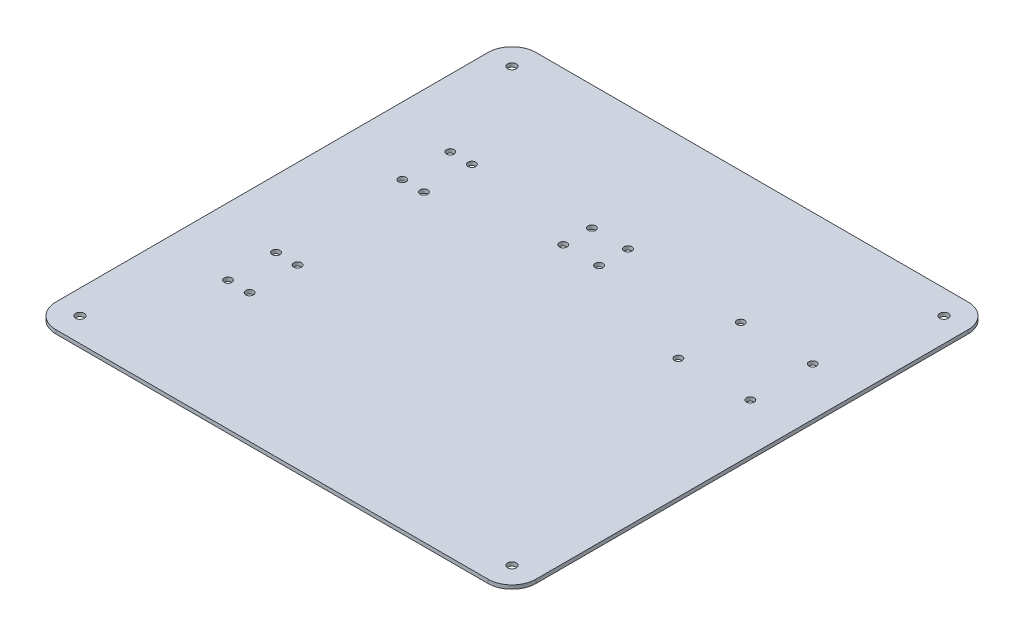
ISO-10303-21;
HEADER;
FILE_DESCRIPTION(('STEP AP214'),'2;1');
FILE_NAME('part.step','',(''),(''),'','','');
FILE_SCHEMA(('AUTOMOTIVE_DESIGN { 1 0 10303 214 1 1 1 1 }'));
ENDSEC;
DATA;
#1=APPLICATION_CONTEXT('core data for automotive mechanical design processes');
#2=APPLICATION_PROTOCOL_DEFINITION('international standard','automotive_design',2000,#1);
#3=PRODUCT_CONTEXT('',#1,'mechanical');
#4=PRODUCT('Part','Part','',(#3));
#5=PRODUCT_RELATED_PRODUCT_CATEGORY('part','',(#4));
#6=PRODUCT_DEFINITION_FORMATION('','',#4);
#7=PRODUCT_DEFINITION_CONTEXT('part definition',#1,'design');
#8=PRODUCT_DEFINITION('design','',#6,#7);
#9=PRODUCT_DEFINITION_SHAPE('','',#8);
#10=(LENGTH_UNIT() NAMED_UNIT(*) SI_UNIT(.MILLI.,.METRE.));
#11=(NAMED_UNIT(*) PLANE_ANGLE_UNIT() SI_UNIT($,.RADIAN.));
#12=(NAMED_UNIT(*) SI_UNIT($,.STERADIAN.) SOLID_ANGLE_UNIT());
#13=UNCERTAINTY_MEASURE_WITH_UNIT(LENGTH_MEASURE(1.E-05),#10,'distance_accuracy_value','');
#14=(GEOMETRIC_REPRESENTATION_CONTEXT(3) GLOBAL_UNCERTAINTY_ASSIGNED_CONTEXT((#13)) GLOBAL_UNIT_ASSIGNED_CONTEXT((#10,
#11,#12)) REPRESENTATION_CONTEXT('',''));
#15=CARTESIAN_POINT('',(0.,0.,0.));
#16=DIRECTION('',(0.,0.,1.));
#17=DIRECTION('',(1.,0.,0.));
#18=AXIS2_PLACEMENT_3D('',#15,#16,#17);
#19=CARTESIAN_POINT('',(100.,1.57,-100.));
#20=DIRECTION('',(-1.,0.,0.));
#21=DIRECTION('',(0.,0.,1.));
#22=AXIS2_PLACEMENT_3D('',#19,#20,#21);
#23=PLANE('',#22);
#24=DIRECTION('',(0.,0.,-1.));
#25=VECTOR('',#24,1.);
#26=CARTESIAN_POINT('',(100.,0.,-100.));
#27=LINE('',#26,#25);
#28=CARTESIAN_POINT('',(100.,0.,90.));
#29=VERTEX_POINT('',#28);
#30=CARTESIAN_POINT('',(100.,0.,-90.));
#31=VERTEX_POINT('',#30);
#32=EDGE_CURVE('E121',#29,#31,#27,.T.);
#33=ORIENTED_EDGE('',*,*,#32,.T.);
#34=DIRECTION('',(0.,-1.,0.));
#35=VECTOR('',#34,1.);
#36=CARTESIAN_POINT('',(100.,1.57,-90.));
#37=LINE('',#36,#35);
#38=CARTESIAN_POINT('',(100.,1.57,-90.));
#39=VERTEX_POINT('',#38);
#40=EDGE_CURVE('E170',#31,#39,#37,.F.);
#41=ORIENTED_EDGE('',*,*,#40,.T.);
#42=DIRECTION('',(0.,0.,-1.));
#43=VECTOR('',#42,1.);
#44=CARTESIAN_POINT('',(100.,1.57,-100.));
#45=LINE('',#44,#43);
#46=CARTESIAN_POINT('',(100.,1.57,90.));
#47=VERTEX_POINT('',#46);
#48=EDGE_CURVE('E124',#47,#39,#45,.T.);
#49=ORIENTED_EDGE('',*,*,#48,.F.);
#50=DIRECTION('',(0.,-1.,0.));
#51=VECTOR('',#50,1.);
#52=CARTESIAN_POINT('',(100.,1.57,90.));
#53=LINE('',#52,#51);
#54=EDGE_CURVE('E111',#47,#29,#53,.T.);
#55=ORIENTED_EDGE('',*,*,#54,.T.);
#56=EDGE_LOOP('',(#33,#41,#49,#55));
#57=FACE_BOUND('',#56,.T.);
#58=ADVANCED_FACE('F39',(#57),#23,.F.);
#59=CARTESIAN_POINT('',(-100.,1.57,-100.));
#60=DIRECTION('',(0.,0.,1.));
#61=DIRECTION('',(1.,0.,0.));
#62=AXIS2_PLACEMENT_3D('',#59,#60,#61);
#63=PLANE('',#62);
#64=DIRECTION('',(-1.,0.,0.));
#65=VECTOR('',#64,1.);
#66=CARTESIAN_POINT('',(-100.,1.57,-100.));
#67=LINE('',#66,#65);
#68=CARTESIAN_POINT('',(90.,1.57,-100.));
#69=VERTEX_POINT('',#68);
#70=CARTESIAN_POINT('',(-90.,1.57,-100.));
#71=VERTEX_POINT('',#70);
#72=EDGE_CURVE('E189',#69,#71,#67,.T.);
#73=ORIENTED_EDGE('',*,*,#72,.F.);
#74=DIRECTION('',(0.,-1.,0.));
#75=VECTOR('',#74,1.);
#76=CARTESIAN_POINT('',(90.,1.57,-100.));
#77=LINE('',#76,#75);
#78=CARTESIAN_POINT('',(90.,0.,-100.));
#79=VERTEX_POINT('',#78);
#80=EDGE_CURVE('E162',#69,#79,#77,.T.);
#81=ORIENTED_EDGE('',*,*,#80,.T.);
#82=DIRECTION('',(-1.,0.,0.));
#83=VECTOR('',#82,1.);
#84=CARTESIAN_POINT('',(-100.,0.,-100.));
#85=LINE('',#84,#83);
#86=CARTESIAN_POINT('',(-90.,0.,-100.));
#87=VERTEX_POINT('',#86);
#88=EDGE_CURVE('E130',#79,#87,#85,.T.);
#89=ORIENTED_EDGE('',*,*,#88,.T.);
#90=DIRECTION('',(0.,-1.,0.));
#91=VECTOR('',#90,1.);
#92=CARTESIAN_POINT('',(-90.,1.57,-100.));
#93=LINE('',#92,#91);
#94=EDGE_CURVE('E160',#87,#71,#93,.F.);
#95=ORIENTED_EDGE('',*,*,#94,.T.);
#96=EDGE_LOOP('',(#73,#81,#89,#95));
#97=FACE_BOUND('',#96,.T.);
#98=ADVANCED_FACE('F355',(#97),#63,.F.);
#99=CARTESIAN_POINT('',(-100.,1.57,-100.));
#100=DIRECTION('',(1.,0.,0.));
#101=DIRECTION('',(0.,0.,-1.));
#102=AXIS2_PLACEMENT_3D('',#99,#100,#101);
#103=PLANE('',#102);
#104=DIRECTION('',(0.,0.,1.));
#105=VECTOR('',#104,1.);
#106=CARTESIAN_POINT('',(-100.,1.57,-100.));
#107=LINE('',#106,#105);
#108=CARTESIAN_POINT('',(-100.,1.57,-90.));
#109=VERTEX_POINT('',#108);
#110=CARTESIAN_POINT('',(-100.,1.57,90.));
#111=VERTEX_POINT('',#110);
#112=EDGE_CURVE('E181',#109,#111,#107,.T.);
#113=ORIENTED_EDGE('',*,*,#112,.F.);
#114=DIRECTION('',(0.,-1.,0.));
#115=VECTOR('',#114,1.);
#116=CARTESIAN_POINT('',(-100.,1.57,-90.));
#117=LINE('',#116,#115);
#118=CARTESIAN_POINT('',(-100.,0.,-90.));
#119=VERTEX_POINT('',#118);
#120=EDGE_CURVE('E47',#109,#119,#117,.T.);
#121=ORIENTED_EDGE('',*,*,#120,.T.);
#122=DIRECTION('',(0.,0.,1.));
#123=VECTOR('',#122,1.);
#124=CARTESIAN_POINT('',(-100.,0.,-100.));
#125=LINE('',#124,#123);
#126=CARTESIAN_POINT('',(-100.,0.,90.));
#127=VERTEX_POINT('',#126);
#128=EDGE_CURVE('E134',#119,#127,#125,.T.);
#129=ORIENTED_EDGE('',*,*,#128,.T.);
#130=DIRECTION('',(0.,-1.,0.));
#131=VECTOR('',#130,1.);
#132=CARTESIAN_POINT('',(-100.,1.57,90.));
#133=LINE('',#132,#131);
#134=EDGE_CURVE('E54',#127,#111,#133,.F.);
#135=ORIENTED_EDGE('',*,*,#134,.T.);
#136=EDGE_LOOP('',(#113,#121,#129,#135));
#137=FACE_BOUND('',#136,.T.);
#138=ADVANCED_FACE('F180',(#137),#103,.F.);
#139=CARTESIAN_POINT('',(-100.,1.57,100.));
#140=DIRECTION('',(0.,0.,-1.));
#141=DIRECTION('',(-1.,0.,0.));
#142=AXIS2_PLACEMENT_3D('',#139,#140,#141);
#143=PLANE('',#142);
#144=DIRECTION('',(1.,0.,0.));
#145=VECTOR('',#144,1.);
#146=CARTESIAN_POINT('',(-100.,1.57,100.));
#147=LINE('',#146,#145);
#148=CARTESIAN_POINT('',(-90.,1.57,100.));
#149=VERTEX_POINT('',#148);
#150=CARTESIAN_POINT('',(90.,1.57,100.));
#151=VERTEX_POINT('',#150);
#152=EDGE_CURVE('E125',#149,#151,#147,.T.);
#153=ORIENTED_EDGE('',*,*,#152,.F.);
#154=DIRECTION('',(0.,-1.,0.));
#155=VECTOR('',#154,1.);
#156=CARTESIAN_POINT('',(-90.,1.57,100.));
#157=LINE('',#156,#155);
#158=CARTESIAN_POINT('',(-90.,0.,100.));
#159=VERTEX_POINT('',#158);
#160=EDGE_CURVE('E11',#149,#159,#157,.T.);
#161=ORIENTED_EDGE('',*,*,#160,.T.);
#162=DIRECTION('',(1.,0.,0.));
#163=VECTOR('',#162,1.);
#164=CARTESIAN_POINT('',(-100.,0.,100.));
#165=LINE('',#164,#163);
#166=CARTESIAN_POINT('',(90.,0.,100.));
#167=VERTEX_POINT('',#166);
#168=EDGE_CURVE('E143',#159,#167,#165,.T.);
#169=ORIENTED_EDGE('',*,*,#168,.T.);
#170=DIRECTION('',(0.,-1.,0.));
#171=VECTOR('',#170,1.);
#172=CARTESIAN_POINT('',(90.,1.57,100.));
#173=LINE('',#172,#171);
#174=EDGE_CURVE('E113',#167,#151,#173,.F.);
#175=ORIENTED_EDGE('',*,*,#174,.T.);
#176=EDGE_LOOP('',(#153,#161,#169,#175));
#177=FACE_BOUND('',#176,.T.);
#178=ADVANCED_FACE('F188',(#177),#143,.F.);
#179=CARTESIAN_POINT('',(0.,1.57,0.));
#180=DIRECTION('',(0.,1.,0.));
#181=DIRECTION('',(0.,0.,1.));
#182=AXIS2_PLACEMENT_3D('',#179,#180,#181);
#183=PLANE('',#182);
#184=CARTESIAN_POINT('',(-14.9999999999999,1.57,-48.3000000000001));
#185=DIRECTION('',(0.,-1.,0.));
#186=DIRECTION('',(0.,0.,-1.));
#187=AXIS2_PLACEMENT_3D('',#184,#185,#186);
#188=CIRCLE('',#187,1.6);
#189=CARTESIAN_POINT('',(-14.9999999999999,1.57,-49.9000000000001));
#190=VERTEX_POINT('',#189);
#191=EDGE_CURVE('E291',#190,#190,#188,.T.);
#192=ORIENTED_EDGE('',*,*,#191,.T.);
#193=EDGE_LOOP('',(#192));
#194=FACE_BOUND('',#193,.T.);
#195=CARTESIAN_POINT('',(1.38777878078145E-13,1.57,-48.3000000000001));
#196=DIRECTION('',(0.,-1.,0.));
#197=DIRECTION('',(0.,0.,-1.));
#198=AXIS2_PLACEMENT_3D('',#195,#196,#197);
#199=CIRCLE('',#198,1.6);
#200=CARTESIAN_POINT('',(1.38777878078145E-13,1.57,-49.9000000000001));
#201=VERTEX_POINT('',#200);
#202=EDGE_CURVE('E285',#201,#201,#199,.T.);
#203=ORIENTED_EDGE('',*,*,#202,.T.);
#204=EDGE_LOOP('',(#203));
#205=FACE_BOUND('',#204,.T.);
#206=CARTESIAN_POINT('',(1.38414978640635E-13,1.57,-36.3000000000001));
#207=DIRECTION('',(0.,-1.,0.));
#208=DIRECTION('',(0.,0.,-1.));
#209=AXIS2_PLACEMENT_3D('',#206,#207,#208);
#210=CIRCLE('',#209,1.6);
#211=CARTESIAN_POINT('',(1.38414978640635E-13,1.57,-37.9000000000001));
#212=VERTEX_POINT('',#211);
#213=EDGE_CURVE('E279',#212,#212,#210,.T.);
#214=ORIENTED_EDGE('',*,*,#213,.T.);
#215=EDGE_LOOP('',(#214));
#216=FACE_BOUND('',#215,.T.);
#217=CARTESIAN_POINT('',(-14.9999999999999,1.57,-36.3000000000001));
#218=DIRECTION('',(0.,-1.,0.));
#219=DIRECTION('',(0.,0.,-1.));
#220=AXIS2_PLACEMENT_3D('',#217,#218,#219);
#221=CIRCLE('',#220,1.6);
#222=CARTESIAN_POINT('',(-14.9999999999999,1.57,-37.9000000000001));
#223=VERTEX_POINT('',#222);
#224=EDGE_CURVE('E273',#223,#223,#221,.T.);
#225=ORIENTED_EDGE('',*,*,#224,.T.);
#226=EDGE_LOOP('',(#225));
#227=FACE_BOUND('',#226,.T.);
#228=CARTESIAN_POINT('',(-63.,1.57,-46.3000000000001));
#229=DIRECTION('',(0.,-1.,0.));
#230=DIRECTION('',(0.,0.,-1.));
#231=AXIS2_PLACEMENT_3D('',#228,#229,#230);
#232=CIRCLE('',#231,1.6);
#233=CARTESIAN_POINT('',(-63.,1.57,-47.9000000000001));
#234=VERTEX_POINT('',#233);
#235=EDGE_CURVE('E267',#234,#234,#232,.T.);
#236=ORIENTED_EDGE('',*,*,#235,.T.);
#237=EDGE_LOOP('',(#236));
#238=FACE_BOUND('',#237,.T.);
#239=CARTESIAN_POINT('',(-72.,1.57,-46.3000000000001));
#240=DIRECTION('',(0.,-1.,0.));
#241=DIRECTION('',(0.,0.,-1.));
#242=AXIS2_PLACEMENT_3D('',#239,#240,#241);
#243=CIRCLE('',#242,1.6);
#244=CARTESIAN_POINT('',(-72.,1.57,-47.9000000000001));
#245=VERTEX_POINT('',#244);
#246=EDGE_CURVE('E261',#245,#245,#243,.T.);
#247=ORIENTED_EDGE('',*,*,#246,.T.);
#248=EDGE_LOOP('',(#247));
#249=FACE_BOUND('',#248,.T.);
#250=CARTESIAN_POINT('',(-63.,1.57,-26.3000000000001));
#251=DIRECTION('',(0.,-1.,0.));
#252=DIRECTION('',(0.,0.,-1.));
#253=AXIS2_PLACEMENT_3D('',#250,#251,#252);
#254=CIRCLE('',#253,1.6);
#255=CARTESIAN_POINT('',(-63.,1.57,-27.9000000000001));
#256=VERTEX_POINT('',#255);
#257=EDGE_CURVE('E255',#256,#256,#254,.T.);
#258=ORIENTED_EDGE('',*,*,#257,.T.);
#259=EDGE_LOOP('',(#258));
#260=FACE_BOUND('',#259,.T.);
#261=CARTESIAN_POINT('',(-72.,1.57,-26.3000000000001));
#262=DIRECTION('',(0.,-1.,0.));
#263=DIRECTION('',(0.,0.,-1.));
#264=AXIS2_PLACEMENT_3D('',#261,#262,#263);
#265=CIRCLE('',#264,1.6);
#266=CARTESIAN_POINT('',(-72.,1.57,-27.9000000000001));
#267=VERTEX_POINT('',#266);
#268=EDGE_CURVE('E249',#267,#267,#265,.T.);
#269=ORIENTED_EDGE('',*,*,#268,.T.);
#270=EDGE_LOOP('',(#269));
#271=FACE_BOUND('',#270,.T.);
#272=CARTESIAN_POINT('',(50.0000000000001,1.57,-45.3));
#273=DIRECTION('',(0.,-1.,0.));
#274=DIRECTION('',(0.,0.,-1.));
#275=AXIS2_PLACEMENT_3D('',#272,#273,#274);
#276=CIRCLE('',#275,1.6);
#277=CARTESIAN_POINT('',(50.0000000000001,1.57,-46.9));
#278=VERTEX_POINT('',#277);
#279=EDGE_CURVE('E243',#278,#278,#276,.T.);
#280=ORIENTED_EDGE('',*,*,#279,.T.);
#281=EDGE_LOOP('',(#280));
#282=FACE_BOUND('',#281,.T.);
#283=CARTESIAN_POINT('',(79.9836818937695,1.57,-45.3));
#284=DIRECTION('',(0.,-1.,0.));
#285=DIRECTION('',(0.,0.,-1.));
#286=AXIS2_PLACEMENT_3D('',#283,#284,#285);
#287=CIRCLE('',#286,1.6);
#288=CARTESIAN_POINT('',(79.9836818937695,1.57,-46.9));
#289=VERTEX_POINT('',#288);
#290=EDGE_CURVE('E237',#289,#289,#287,.T.);
#291=ORIENTED_EDGE('',*,*,#290,.T.);
#292=EDGE_LOOP('',(#291));
#293=FACE_BOUND('',#292,.T.);
#294=CARTESIAN_POINT('',(79.9836818937695,1.57,-19.3));
#295=DIRECTION('',(0.,-1.,0.));
#296=DIRECTION('',(0.,0.,-1.));
#297=AXIS2_PLACEMENT_3D('',#294,#295,#296);
#298=CIRCLE('',#297,1.6);
#299=CARTESIAN_POINT('',(79.9836818937695,1.57,-20.9));
#300=VERTEX_POINT('',#299);
#301=EDGE_CURVE('E231',#300,#300,#298,.T.);
#302=ORIENTED_EDGE('',*,*,#301,.T.);
#303=EDGE_LOOP('',(#302));
#304=FACE_BOUND('',#303,.T.);
#305=CARTESIAN_POINT('',(50.0000000000001,1.57,-19.3));
#306=DIRECTION('',(0.,-1.,0.));
#307=DIRECTION('',(0.,0.,-1.));
#308=AXIS2_PLACEMENT_3D('',#305,#306,#307);
#309=CIRCLE('',#308,1.6);
#310=CARTESIAN_POINT('',(50.0000000000001,1.57,-20.9));
#311=VERTEX_POINT('',#310);
#312=EDGE_CURVE('E225',#311,#311,#309,.T.);
#313=ORIENTED_EDGE('',*,*,#312,.T.);
#314=EDGE_LOOP('',(#313));
#315=FACE_BOUND('',#314,.T.);
#316=CARTESIAN_POINT('',(-72.,1.57,26.3));
#317=DIRECTION('',(0.,-1.,0.));
#318=DIRECTION('',(0.,0.,-1.));
#319=AXIS2_PLACEMENT_3D('',#316,#317,#318);
#320=CIRCLE('',#319,1.6);
#321=CARTESIAN_POINT('',(-72.,1.57,24.7));
#322=VERTEX_POINT('',#321);
#323=EDGE_CURVE('E219',#322,#322,#320,.T.);
#324=ORIENTED_EDGE('',*,*,#323,.T.);
#325=EDGE_LOOP('',(#324));
#326=FACE_BOUND('',#325,.T.);
#327=CARTESIAN_POINT('',(-63.,1.57,26.3));
#328=DIRECTION('',(0.,-1.,0.));
#329=DIRECTION('',(0.,0.,-1.));
#330=AXIS2_PLACEMENT_3D('',#327,#328,#329);
#331=CIRCLE('',#330,1.6);
#332=CARTESIAN_POINT('',(-63.,1.57,24.7));
#333=VERTEX_POINT('',#332);
#334=EDGE_CURVE('E213',#333,#333,#331,.T.);
#335=ORIENTED_EDGE('',*,*,#334,.T.);
#336=EDGE_LOOP('',(#335));
#337=FACE_BOUND('',#336,.T.);
#338=CARTESIAN_POINT('',(-63.,1.57,46.3));
#339=DIRECTION('',(0.,-1.,0.));
#340=DIRECTION('',(0.,0.,-1.));
#341=AXIS2_PLACEMENT_3D('',#338,#339,#340);
#342=CIRCLE('',#341,1.6);
#343=CARTESIAN_POINT('',(-63.,1.57,44.7));
#344=VERTEX_POINT('',#343);
#345=EDGE_CURVE('E207',#344,#344,#342,.T.);
#346=ORIENTED_EDGE('',*,*,#345,.T.);
#347=EDGE_LOOP('',(#346));
#348=FACE_BOUND('',#347,.T.);
#349=CARTESIAN_POINT('',(-72.,1.57,46.3));
#350=DIRECTION('',(0.,-1.,0.));
#351=DIRECTION('',(0.,0.,-1.));
#352=AXIS2_PLACEMENT_3D('',#349,#350,#351);
#353=CIRCLE('',#352,1.6);
#354=CARTESIAN_POINT('',(-72.,1.57,44.7));
#355=VERTEX_POINT('',#354);
#356=EDGE_CURVE('E201',#355,#355,#353,.T.);
#357=ORIENTED_EDGE('',*,*,#356,.T.);
#358=EDGE_LOOP('',(#357));
#359=FACE_BOUND('',#358,.T.);
#360=CARTESIAN_POINT('',(-90.,1.57,-90.));
#361=DIRECTION('',(0.,1.,0.));
#362=DIRECTION('',(0.,0.,1.));
#363=AXIS2_PLACEMENT_3D('',#360,#361,#362);
#364=CIRCLE('',#363,1.8);
#365=CARTESIAN_POINT('',(-90.,1.57,-88.2));
#366=VERTEX_POINT('',#365);
#367=EDGE_CURVE('E155',#366,#366,#364,.T.);
#368=ORIENTED_EDGE('',*,*,#367,.F.);
#369=EDGE_LOOP('',(#368));
#370=FACE_BOUND('',#369,.T.);
#371=CARTESIAN_POINT('',(90.,1.57,-90.));
#372=DIRECTION('',(0.,1.,0.));
#373=DIRECTION('',(0.,0.,1.));
#374=AXIS2_PLACEMENT_3D('',#371,#372,#373);
#375=CIRCLE('',#374,1.8);
#376=CARTESIAN_POINT('',(90.,1.57,-88.2));
#377=VERTEX_POINT('',#376);
#378=EDGE_CURVE('E152',#377,#377,#375,.T.);
#379=ORIENTED_EDGE('',*,*,#378,.F.);
#380=EDGE_LOOP('',(#379));
#381=FACE_BOUND('',#380,.T.);
#382=CARTESIAN_POINT('',(90.,1.57,90.));
#383=DIRECTION('',(0.,1.,0.));
#384=DIRECTION('',(0.,0.,1.));
#385=AXIS2_PLACEMENT_3D('',#382,#383,#384);
#386=CIRCLE('',#385,1.8);
#387=CARTESIAN_POINT('',(90.,1.57,91.8));
#388=VERTEX_POINT('',#387);
#389=EDGE_CURVE('E148',#388,#388,#386,.T.);
#390=ORIENTED_EDGE('',*,*,#389,.F.);
#391=EDGE_LOOP('',(#390));
#392=FACE_BOUND('',#391,.T.);
#393=CARTESIAN_POINT('',(-90.,1.57,90.));
#394=DIRECTION('',(0.,1.,0.));
#395=DIRECTION('',(0.,0.,1.));
#396=AXIS2_PLACEMENT_3D('',#393,#394,#395);
#397=CIRCLE('',#396,1.8);
#398=CARTESIAN_POINT('',(-90.,1.57,91.8));
#399=VERTEX_POINT('',#398);
#400=EDGE_CURVE('E137',#399,#399,#397,.T.);
#401=ORIENTED_EDGE('',*,*,#400,.F.);
#402=EDGE_LOOP('',(#401));
#403=FACE_BOUND('',#402,.T.);
#404=ORIENTED_EDGE('',*,*,#48,.T.);
#405=CARTESIAN_POINT('',(90.,1.57,-90.));
#406=DIRECTION('',(0.,1.,0.));
#407=DIRECTION('',(0.,0.,1.));
#408=AXIS2_PLACEMENT_3D('',#405,#406,#407);
#409=CIRCLE('',#408,10.);
#410=EDGE_CURVE('E175',#39,#69,#409,.T.);
#411=ORIENTED_EDGE('',*,*,#410,.T.);
#412=ORIENTED_EDGE('',*,*,#72,.T.);
#413=CARTESIAN_POINT('',(-90.,1.57,-90.));
#414=DIRECTION('',(0.,1.,0.));
#415=DIRECTION('',(0.,0.,1.));
#416=AXIS2_PLACEMENT_3D('',#413,#414,#415);
#417=CIRCLE('',#416,10.);
#418=EDGE_CURVE('E61',#71,#109,#417,.T.);
#419=ORIENTED_EDGE('',*,*,#418,.T.);
#420=ORIENTED_EDGE('',*,*,#112,.T.);
#421=CARTESIAN_POINT('',(-90.,1.57,90.));
#422=DIRECTION('',(0.,1.,0.));
#423=DIRECTION('',(0.,0.,1.));
#424=AXIS2_PLACEMENT_3D('',#421,#422,#423);
#425=CIRCLE('',#424,10.);
#426=EDGE_CURVE('E172',#111,#149,#425,.T.);
#427=ORIENTED_EDGE('',*,*,#426,.T.);
#428=ORIENTED_EDGE('',*,*,#152,.T.);
#429=CARTESIAN_POINT('',(90.,1.57,90.));
#430=DIRECTION('',(0.,1.,0.));
#431=DIRECTION('',(0.,0.,1.));
#432=AXIS2_PLACEMENT_3D('',#429,#430,#431);
#433=CIRCLE('',#432,10.);
#434=EDGE_CURVE('E158',#151,#47,#433,.T.);
#435=ORIENTED_EDGE('',*,*,#434,.T.);
#436=EDGE_LOOP('',(#404,#411,#412,#419,#420,#427,#428,#435));
#437=FACE_BOUND('',#436,.T.);
#438=ADVANCED_FACE('F303',(#194,#205,#216,#227,#238,#249,#260,#271,#282,#293,#304,#315,#326,
#337,#348,#359,#370,#381,#392,#403,#437),#183,.T.);
#439=CARTESIAN_POINT('',(0.,0.,0.));
#440=DIRECTION('',(0.,1.,0.));
#441=DIRECTION('',(0.,0.,1.));
#442=AXIS2_PLACEMENT_3D('',#439,#440,#441);
#443=PLANE('',#442);
#444=CARTESIAN_POINT('',(-14.9999999999999,0.,-48.3000000000001));
#445=DIRECTION('',(0.,-1.,0.));
#446=DIRECTION('',(0.,0.,-1.));
#447=AXIS2_PLACEMENT_3D('',#444,#445,#446);
#448=CIRCLE('',#447,1.59999999999999);
#449=CARTESIAN_POINT('',(-14.9999999999999,0.,-49.9000000000001));
#450=VERTEX_POINT('',#449);
#451=EDGE_CURVE('E294',#450,#450,#448,.T.);
#452=ORIENTED_EDGE('',*,*,#451,.F.);
#453=EDGE_LOOP('',(#452));
#454=FACE_BOUND('',#453,.T.);
#455=CARTESIAN_POINT('',(1.38777878078145E-13,0.,-48.3000000000001));
#456=DIRECTION('',(0.,-1.,0.));
#457=DIRECTION('',(0.,0.,-1.));
#458=AXIS2_PLACEMENT_3D('',#455,#456,#457);
#459=CIRCLE('',#458,1.59999999999999);
#460=CARTESIAN_POINT('',(1.38777878078145E-13,0.,-49.9000000000001));
#461=VERTEX_POINT('',#460);
#462=EDGE_CURVE('E288',#461,#461,#459,.T.);
#463=ORIENTED_EDGE('',*,*,#462,.F.);
#464=EDGE_LOOP('',(#463));
#465=FACE_BOUND('',#464,.T.);
#466=CARTESIAN_POINT('',(1.38414978640635E-13,0.,-36.3000000000001));
#467=DIRECTION('',(0.,-1.,0.));
#468=DIRECTION('',(0.,0.,-1.));
#469=AXIS2_PLACEMENT_3D('',#466,#467,#468);
#470=CIRCLE('',#469,1.59999999999999);
#471=CARTESIAN_POINT('',(1.38414978640635E-13,0.,-37.9000000000001));
#472=VERTEX_POINT('',#471);
#473=EDGE_CURVE('E282',#472,#472,#470,.T.);
#474=ORIENTED_EDGE('',*,*,#473,.F.);
#475=EDGE_LOOP('',(#474));
#476=FACE_BOUND('',#475,.T.);
#477=CARTESIAN_POINT('',(-14.9999999999999,0.,-36.3000000000001));
#478=DIRECTION('',(0.,-1.,0.));
#479=DIRECTION('',(0.,0.,-1.));
#480=AXIS2_PLACEMENT_3D('',#477,#478,#479);
#481=CIRCLE('',#480,1.59999999999999);
#482=CARTESIAN_POINT('',(-14.9999999999999,0.,-37.9000000000001));
#483=VERTEX_POINT('',#482);
#484=EDGE_CURVE('E276',#483,#483,#481,.T.);
#485=ORIENTED_EDGE('',*,*,#484,.F.);
#486=EDGE_LOOP('',(#485));
#487=FACE_BOUND('',#486,.T.);
#488=CARTESIAN_POINT('',(-63.,0.,-46.3000000000001));
#489=DIRECTION('',(0.,-1.,0.));
#490=DIRECTION('',(0.,0.,-1.));
#491=AXIS2_PLACEMENT_3D('',#488,#489,#490);
#492=CIRCLE('',#491,1.59999999999999);
#493=CARTESIAN_POINT('',(-63.,0.,-47.9000000000001));
#494=VERTEX_POINT('',#493);
#495=EDGE_CURVE('E270',#494,#494,#492,.T.);
#496=ORIENTED_EDGE('',*,*,#495,.F.);
#497=EDGE_LOOP('',(#496));
#498=FACE_BOUND('',#497,.T.);
#499=CARTESIAN_POINT('',(-72.,0.,-46.3000000000001));
#500=DIRECTION('',(0.,-1.,0.));
#501=DIRECTION('',(0.,0.,-1.));
#502=AXIS2_PLACEMENT_3D('',#499,#500,#501);
#503=CIRCLE('',#502,1.59999999999999);
#504=CARTESIAN_POINT('',(-72.,0.,-47.9000000000001));
#505=VERTEX_POINT('',#504);
#506=EDGE_CURVE('E264',#505,#505,#503,.T.);
#507=ORIENTED_EDGE('',*,*,#506,.F.);
#508=EDGE_LOOP('',(#507));
#509=FACE_BOUND('',#508,.T.);
#510=CARTESIAN_POINT('',(-63.,0.,-26.3000000000001));
#511=DIRECTION('',(0.,-1.,0.));
#512=DIRECTION('',(0.,0.,-1.));
#513=AXIS2_PLACEMENT_3D('',#510,#511,#512);
#514=CIRCLE('',#513,1.59999999999999);
#515=CARTESIAN_POINT('',(-63.,0.,-27.9000000000001));
#516=VERTEX_POINT('',#515);
#517=EDGE_CURVE('E258',#516,#516,#514,.T.);
#518=ORIENTED_EDGE('',*,*,#517,.F.);
#519=EDGE_LOOP('',(#518));
#520=FACE_BOUND('',#519,.T.);
#521=CARTESIAN_POINT('',(-72.,0.,-26.3000000000001));
#522=DIRECTION('',(0.,-1.,0.));
#523=DIRECTION('',(0.,0.,-1.));
#524=AXIS2_PLACEMENT_3D('',#521,#522,#523);
#525=CIRCLE('',#524,1.59999999999999);
#526=CARTESIAN_POINT('',(-72.,0.,-27.9000000000001));
#527=VERTEX_POINT('',#526);
#528=EDGE_CURVE('E252',#527,#527,#525,.T.);
#529=ORIENTED_EDGE('',*,*,#528,.F.);
#530=EDGE_LOOP('',(#529));
#531=FACE_BOUND('',#530,.T.);
#532=CARTESIAN_POINT('',(50.0000000000001,0.,-45.3));
#533=DIRECTION('',(0.,-1.,0.));
#534=DIRECTION('',(0.,0.,-1.));
#535=AXIS2_PLACEMENT_3D('',#532,#533,#534);
#536=CIRCLE('',#535,1.59999999999999);
#537=CARTESIAN_POINT('',(50.0000000000001,0.,-46.9));
#538=VERTEX_POINT('',#537);
#539=EDGE_CURVE('E246',#538,#538,#536,.T.);
#540=ORIENTED_EDGE('',*,*,#539,.F.);
#541=EDGE_LOOP('',(#540));
#542=FACE_BOUND('',#541,.T.);
#543=CARTESIAN_POINT('',(79.9836818937695,0.,-45.3));
#544=DIRECTION('',(0.,-1.,0.));
#545=DIRECTION('',(0.,0.,-1.));
#546=AXIS2_PLACEMENT_3D('',#543,#544,#545);
#547=CIRCLE('',#546,1.59999999999999);
#548=CARTESIAN_POINT('',(79.9836818937695,0.,-46.9));
#549=VERTEX_POINT('',#548);
#550=EDGE_CURVE('E240',#549,#549,#547,.T.);
#551=ORIENTED_EDGE('',*,*,#550,.F.);
#552=EDGE_LOOP('',(#551));
#553=FACE_BOUND('',#552,.T.);
#554=CARTESIAN_POINT('',(79.9836818937695,0.,-19.3));
#555=DIRECTION('',(0.,-1.,0.));
#556=DIRECTION('',(0.,0.,-1.));
#557=AXIS2_PLACEMENT_3D('',#554,#555,#556);
#558=CIRCLE('',#557,1.59999999999999);
#559=CARTESIAN_POINT('',(79.9836818937695,0.,-20.9));
#560=VERTEX_POINT('',#559);
#561=EDGE_CURVE('E234',#560,#560,#558,.T.);
#562=ORIENTED_EDGE('',*,*,#561,.F.);
#563=EDGE_LOOP('',(#562));
#564=FACE_BOUND('',#563,.T.);
#565=CARTESIAN_POINT('',(50.0000000000001,0.,-19.3));
#566=DIRECTION('',(0.,-1.,0.));
#567=DIRECTION('',(0.,0.,-1.));
#568=AXIS2_PLACEMENT_3D('',#565,#566,#567);
#569=CIRCLE('',#568,1.59999999999999);
#570=CARTESIAN_POINT('',(50.0000000000001,0.,-20.9));
#571=VERTEX_POINT('',#570);
#572=EDGE_CURVE('E228',#571,#571,#569,.T.);
#573=ORIENTED_EDGE('',*,*,#572,.F.);
#574=EDGE_LOOP('',(#573));
#575=FACE_BOUND('',#574,.T.);
#576=CARTESIAN_POINT('',(-72.,0.,26.3));
#577=DIRECTION('',(0.,-1.,0.));
#578=DIRECTION('',(0.,0.,-1.));
#579=AXIS2_PLACEMENT_3D('',#576,#577,#578);
#580=CIRCLE('',#579,1.59999999999999);
#581=CARTESIAN_POINT('',(-72.,0.,24.7));
#582=VERTEX_POINT('',#581);
#583=EDGE_CURVE('E222',#582,#582,#580,.T.);
#584=ORIENTED_EDGE('',*,*,#583,.F.);
#585=EDGE_LOOP('',(#584));
#586=FACE_BOUND('',#585,.T.);
#587=CARTESIAN_POINT('',(-63.,0.,26.3));
#588=DIRECTION('',(0.,-1.,0.));
#589=DIRECTION('',(0.,0.,-1.));
#590=AXIS2_PLACEMENT_3D('',#587,#588,#589);
#591=CIRCLE('',#590,1.59999999999999);
#592=CARTESIAN_POINT('',(-63.,0.,24.7));
#593=VERTEX_POINT('',#592);
#594=EDGE_CURVE('E216',#593,#593,#591,.T.);
#595=ORIENTED_EDGE('',*,*,#594,.F.);
#596=EDGE_LOOP('',(#595));
#597=FACE_BOUND('',#596,.T.);
#598=CARTESIAN_POINT('',(-63.,0.,46.3));
#599=DIRECTION('',(0.,-1.,0.));
#600=DIRECTION('',(0.,0.,-1.));
#601=AXIS2_PLACEMENT_3D('',#598,#599,#600);
#602=CIRCLE('',#601,1.59999999999999);
#603=CARTESIAN_POINT('',(-63.,0.,44.7));
#604=VERTEX_POINT('',#603);
#605=EDGE_CURVE('E210',#604,#604,#602,.T.);
#606=ORIENTED_EDGE('',*,*,#605,.F.);
#607=EDGE_LOOP('',(#606));
#608=FACE_BOUND('',#607,.T.);
#609=CARTESIAN_POINT('',(-72.,0.,46.3));
#610=DIRECTION('',(0.,-1.,0.));
#611=DIRECTION('',(0.,0.,-1.));
#612=AXIS2_PLACEMENT_3D('',#609,#610,#611);
#613=CIRCLE('',#612,1.59999999999999);
#614=CARTESIAN_POINT('',(-72.,0.,44.7));
#615=VERTEX_POINT('',#614);
#616=EDGE_CURVE('E204',#615,#615,#613,.T.);
#617=ORIENTED_EDGE('',*,*,#616,.F.);
#618=EDGE_LOOP('',(#617));
#619=FACE_BOUND('',#618,.T.);
#620=CARTESIAN_POINT('',(-90.,0.,-90.));
#621=DIRECTION('',(0.,1.,0.));
#622=DIRECTION('',(0.,0.,1.));
#623=AXIS2_PLACEMENT_3D('',#620,#621,#622);
#624=CIRCLE('',#623,1.8);
#625=CARTESIAN_POINT('',(-90.,0.,-88.2));
#626=VERTEX_POINT('',#625);
#627=EDGE_CURVE('E153',#626,#626,#624,.T.);
#628=ORIENTED_EDGE('',*,*,#627,.T.);
#629=EDGE_LOOP('',(#628));
#630=FACE_BOUND('',#629,.T.);
#631=CARTESIAN_POINT('',(90.,0.,-90.));
#632=DIRECTION('',(0.,1.,0.));
#633=DIRECTION('',(0.,0.,1.));
#634=AXIS2_PLACEMENT_3D('',#631,#632,#633);
#635=CIRCLE('',#634,1.8);
#636=CARTESIAN_POINT('',(90.,0.,-88.2));
#637=VERTEX_POINT('',#636);
#638=EDGE_CURVE('E149',#637,#637,#635,.T.);
#639=ORIENTED_EDGE('',*,*,#638,.T.);
#640=EDGE_LOOP('',(#639));
#641=FACE_BOUND('',#640,.T.);
#642=CARTESIAN_POINT('',(90.,0.,90.));
#643=DIRECTION('',(0.,1.,0.));
#644=DIRECTION('',(0.,0.,1.));
#645=AXIS2_PLACEMENT_3D('',#642,#643,#644);
#646=CIRCLE('',#645,1.8);
#647=CARTESIAN_POINT('',(90.,0.,91.8));
#648=VERTEX_POINT('',#647);
#649=EDGE_CURVE('E145',#648,#648,#646,.T.);
#650=ORIENTED_EDGE('',*,*,#649,.T.);
#651=EDGE_LOOP('',(#650));
#652=FACE_BOUND('',#651,.T.);
#653=CARTESIAN_POINT('',(-90.,0.,90.));
#654=DIRECTION('',(0.,1.,0.));
#655=DIRECTION('',(0.,0.,1.));
#656=AXIS2_PLACEMENT_3D('',#653,#654,#655);
#657=CIRCLE('',#656,1.8);
#658=CARTESIAN_POINT('',(-90.,0.,91.8));
#659=VERTEX_POINT('',#658);
#660=EDGE_CURVE('E131',#659,#659,#657,.T.);
#661=ORIENTED_EDGE('',*,*,#660,.T.);
#662=EDGE_LOOP('',(#661));
#663=FACE_BOUND('',#662,.T.);
#664=ORIENTED_EDGE('',*,*,#88,.F.);
#665=CARTESIAN_POINT('',(90.,0.,-90.));
#666=DIRECTION('',(0.,1.,0.));
#667=DIRECTION('',(0.,0.,1.));
#668=AXIS2_PLACEMENT_3D('',#665,#666,#667);
#669=CIRCLE('',#668,10.);
#670=EDGE_CURVE('E129',#79,#31,#669,.F.);
#671=ORIENTED_EDGE('',*,*,#670,.T.);
#672=ORIENTED_EDGE('',*,*,#32,.F.);
#673=CARTESIAN_POINT('',(90.,0.,90.));
#674=DIRECTION('',(0.,1.,0.));
#675=DIRECTION('',(0.,0.,1.));
#676=AXIS2_PLACEMENT_3D('',#673,#674,#675);
#677=CIRCLE('',#676,10.);
#678=EDGE_CURVE('E107',#29,#167,#677,.F.);
#679=ORIENTED_EDGE('',*,*,#678,.T.);
#680=ORIENTED_EDGE('',*,*,#168,.F.);
#681=CARTESIAN_POINT('',(-90.,0.,90.));
#682=DIRECTION('',(0.,1.,0.));
#683=DIRECTION('',(0.,0.,1.));
#684=AXIS2_PLACEMENT_3D('',#681,#682,#683);
#685=CIRCLE('',#684,10.);
#686=EDGE_CURVE('E165',#159,#127,#685,.F.);
#687=ORIENTED_EDGE('',*,*,#686,.T.);
#688=ORIENTED_EDGE('',*,*,#128,.F.);
#689=CARTESIAN_POINT('',(-90.,0.,-90.));
#690=DIRECTION('',(0.,1.,0.));
#691=DIRECTION('',(0.,0.,1.));
#692=AXIS2_PLACEMENT_3D('',#689,#690,#691);
#693=CIRCLE('',#692,10.);
#694=EDGE_CURVE('E167',#119,#87,#693,.F.);
#695=ORIENTED_EDGE('',*,*,#694,.T.);
#696=EDGE_LOOP('',(#664,#671,#672,#679,#680,#687,#688,#695));
#697=FACE_BOUND('',#696,.T.);
#698=ADVANCED_FACE('F128',(#454,#465,#476,#487,#498,#509,#520,#531,#542,#553,#564,#575,#586,
#597,#608,#619,#630,#641,#652,#663,#697),#443,.F.);
#699=CARTESIAN_POINT('',(-90.,1.57,90.));
#700=DIRECTION('',(0.,1.,0.));
#701=DIRECTION('',(0.,0.,1.));
#702=AXIS2_PLACEMENT_3D('',#699,#700,#701);
#703=CYLINDRICAL_SURFACE('',#702,1.8);
#704=ORIENTED_EDGE('',*,*,#400,.T.);
#705=EDGE_LOOP('',(#704));
#706=FACE_BOUND('',#705,.T.);
#707=ORIENTED_EDGE('',*,*,#660,.F.);
#708=EDGE_LOOP('',(#707));
#709=FACE_BOUND('',#708,.T.);
#710=ADVANCED_FACE('F302',(#706,#709),#703,.F.);
#711=CARTESIAN_POINT('',(90.,1.57,90.));
#712=DIRECTION('',(0.,1.,0.));
#713=DIRECTION('',(0.,0.,1.));
#714=AXIS2_PLACEMENT_3D('',#711,#712,#713);
#715=CYLINDRICAL_SURFACE('',#714,1.8);
#716=ORIENTED_EDGE('',*,*,#389,.T.);
#717=EDGE_LOOP('',(#716));
#718=FACE_BOUND('',#717,.T.);
#719=ORIENTED_EDGE('',*,*,#649,.F.);
#720=EDGE_LOOP('',(#719));
#721=FACE_BOUND('',#720,.T.);
#722=ADVANCED_FACE('F344',(#718,#721),#715,.F.);
#723=CARTESIAN_POINT('',(90.,1.57,-90.));
#724=DIRECTION('',(0.,1.,0.));
#725=DIRECTION('',(0.,0.,1.));
#726=AXIS2_PLACEMENT_3D('',#723,#724,#725);
#727=CYLINDRICAL_SURFACE('',#726,1.8);
#728=ORIENTED_EDGE('',*,*,#378,.T.);
#729=EDGE_LOOP('',(#728));
#730=FACE_BOUND('',#729,.T.);
#731=ORIENTED_EDGE('',*,*,#638,.F.);
#732=EDGE_LOOP('',(#731));
#733=FACE_BOUND('',#732,.T.);
#734=ADVANCED_FACE('F350',(#730,#733),#727,.F.);
#735=CARTESIAN_POINT('',(-90.,1.57,-90.));
#736=DIRECTION('',(0.,1.,0.));
#737=DIRECTION('',(0.,0.,1.));
#738=AXIS2_PLACEMENT_3D('',#735,#736,#737);
#739=CYLINDRICAL_SURFACE('',#738,1.8);
#740=ORIENTED_EDGE('',*,*,#367,.T.);
#741=EDGE_LOOP('',(#740));
#742=FACE_BOUND('',#741,.T.);
#743=ORIENTED_EDGE('',*,*,#627,.F.);
#744=EDGE_LOOP('',(#743));
#745=FACE_BOUND('',#744,.T.);
#746=ADVANCED_FACE('F553',(#742,#745),#739,.F.);
#747=CARTESIAN_POINT('',(-72.,0.,46.3));
#748=DIRECTION('',(0.,-1.,0.));
#749=DIRECTION('',(0.,0.,-1.));
#750=AXIS2_PLACEMENT_3D('',#747,#748,#749);
#751=CYLINDRICAL_SURFACE('',#750,1.6);
#752=ORIENTED_EDGE('',*,*,#356,.F.);
#753=EDGE_LOOP('',(#752));
#754=FACE_BOUND('',#753,.T.);
#755=ORIENTED_EDGE('',*,*,#616,.T.);
#756=EDGE_LOOP('',(#755));
#757=FACE_BOUND('',#756,.T.);
#758=ADVANCED_FACE('F545',(#754,#757),#751,.F.);
#759=CARTESIAN_POINT('',(-63.,0.,46.3));
#760=DIRECTION('',(0.,-1.,0.));
#761=DIRECTION('',(0.,0.,-1.));
#762=AXIS2_PLACEMENT_3D('',#759,#760,#761);
#763=CYLINDRICAL_SURFACE('',#762,1.59999999999999);
#764=ORIENTED_EDGE('',*,*,#345,.F.);
#765=EDGE_LOOP('',(#764));
#766=FACE_BOUND('',#765,.T.);
#767=ORIENTED_EDGE('',*,*,#605,.T.);
#768=EDGE_LOOP('',(#767));
#769=FACE_BOUND('',#768,.T.);
#770=ADVANCED_FACE('F537',(#766,#769),#763,.F.);
#771=CARTESIAN_POINT('',(-63.,0.,26.3));
#772=DIRECTION('',(0.,-1.,0.));
#773=DIRECTION('',(0.,0.,-1.));
#774=AXIS2_PLACEMENT_3D('',#771,#772,#773);
#775=CYLINDRICAL_SURFACE('',#774,1.59999999999999);
#776=ORIENTED_EDGE('',*,*,#334,.F.);
#777=EDGE_LOOP('',(#776));
#778=FACE_BOUND('',#777,.T.);
#779=ORIENTED_EDGE('',*,*,#594,.T.);
#780=EDGE_LOOP('',(#779));
#781=FACE_BOUND('',#780,.T.);
#782=ADVANCED_FACE('F529',(#778,#781),#775,.F.);
#783=CARTESIAN_POINT('',(-72.,0.,26.3));
#784=DIRECTION('',(0.,-1.,0.));
#785=DIRECTION('',(0.,0.,-1.));
#786=AXIS2_PLACEMENT_3D('',#783,#784,#785);
#787=CYLINDRICAL_SURFACE('',#786,1.6);
#788=ORIENTED_EDGE('',*,*,#323,.F.);
#789=EDGE_LOOP('',(#788));
#790=FACE_BOUND('',#789,.T.);
#791=ORIENTED_EDGE('',*,*,#583,.T.);
#792=EDGE_LOOP('',(#791));
#793=FACE_BOUND('',#792,.T.);
#794=ADVANCED_FACE('F521',(#790,#793),#787,.F.);
#795=CARTESIAN_POINT('',(50.0000000000001,0.,-19.3));
#796=DIRECTION('',(0.,-1.,0.));
#797=DIRECTION('',(0.,0.,-1.));
#798=AXIS2_PLACEMENT_3D('',#795,#796,#797);
#799=CYLINDRICAL_SURFACE('',#798,1.59999999999999);
#800=ORIENTED_EDGE('',*,*,#312,.F.);
#801=EDGE_LOOP('',(#800));
#802=FACE_BOUND('',#801,.T.);
#803=ORIENTED_EDGE('',*,*,#572,.T.);
#804=EDGE_LOOP('',(#803));
#805=FACE_BOUND('',#804,.T.);
#806=ADVANCED_FACE('F513',(#802,#805),#799,.F.);
#807=CARTESIAN_POINT('',(79.9836818937695,0.,-19.3));
#808=DIRECTION('',(0.,-1.,0.));
#809=DIRECTION('',(0.,0.,-1.));
#810=AXIS2_PLACEMENT_3D('',#807,#808,#809);
#811=CYLINDRICAL_SURFACE('',#810,1.6);
#812=ORIENTED_EDGE('',*,*,#301,.F.);
#813=EDGE_LOOP('',(#812));
#814=FACE_BOUND('',#813,.T.);
#815=ORIENTED_EDGE('',*,*,#561,.T.);
#816=EDGE_LOOP('',(#815));
#817=FACE_BOUND('',#816,.T.);
#818=ADVANCED_FACE('F505',(#814,#817),#811,.F.);
#819=CARTESIAN_POINT('',(79.9836818937695,0.,-45.3));
#820=DIRECTION('',(0.,-1.,0.));
#821=DIRECTION('',(0.,0.,-1.));
#822=AXIS2_PLACEMENT_3D('',#819,#820,#821);
#823=CYLINDRICAL_SURFACE('',#822,1.6);
#824=ORIENTED_EDGE('',*,*,#290,.F.);
#825=EDGE_LOOP('',(#824));
#826=FACE_BOUND('',#825,.T.);
#827=ORIENTED_EDGE('',*,*,#550,.T.);
#828=EDGE_LOOP('',(#827));
#829=FACE_BOUND('',#828,.T.);
#830=ADVANCED_FACE('F497',(#826,#829),#823,.F.);
#831=CARTESIAN_POINT('',(50.0000000000001,0.,-45.3));
#832=DIRECTION('',(0.,-1.,0.));
#833=DIRECTION('',(0.,0.,-1.));
#834=AXIS2_PLACEMENT_3D('',#831,#832,#833);
#835=CYLINDRICAL_SURFACE('',#834,1.59999999999999);
#836=ORIENTED_EDGE('',*,*,#279,.F.);
#837=EDGE_LOOP('',(#836));
#838=FACE_BOUND('',#837,.T.);
#839=ORIENTED_EDGE('',*,*,#539,.T.);
#840=EDGE_LOOP('',(#839));
#841=FACE_BOUND('',#840,.T.);
#842=ADVANCED_FACE('F489',(#838,#841),#835,.F.);
#843=CARTESIAN_POINT('',(-72.,0.,-26.3000000000001));
#844=DIRECTION('',(0.,-1.,0.));
#845=DIRECTION('',(0.,0.,-1.));
#846=AXIS2_PLACEMENT_3D('',#843,#844,#845);
#847=CYLINDRICAL_SURFACE('',#846,1.6);
#848=ORIENTED_EDGE('',*,*,#268,.F.);
#849=EDGE_LOOP('',(#848));
#850=FACE_BOUND('',#849,.T.);
#851=ORIENTED_EDGE('',*,*,#528,.T.);
#852=EDGE_LOOP('',(#851));
#853=FACE_BOUND('',#852,.T.);
#854=ADVANCED_FACE('F481',(#850,#853),#847,.F.);
#855=CARTESIAN_POINT('',(-63.,0.,-26.3000000000001));
#856=DIRECTION('',(0.,-1.,0.));
#857=DIRECTION('',(0.,0.,-1.));
#858=AXIS2_PLACEMENT_3D('',#855,#856,#857);
#859=CYLINDRICAL_SURFACE('',#858,1.59999999999999);
#860=ORIENTED_EDGE('',*,*,#257,.F.);
#861=EDGE_LOOP('',(#860));
#862=FACE_BOUND('',#861,.T.);
#863=ORIENTED_EDGE('',*,*,#517,.T.);
#864=EDGE_LOOP('',(#863));
#865=FACE_BOUND('',#864,.T.);
#866=ADVANCED_FACE('F473',(#862,#865),#859,.F.);
#867=CARTESIAN_POINT('',(-72.,0.,-46.3000000000001));
#868=DIRECTION('',(0.,-1.,0.));
#869=DIRECTION('',(0.,0.,-1.));
#870=AXIS2_PLACEMENT_3D('',#867,#868,#869);
#871=CYLINDRICAL_SURFACE('',#870,1.6);
#872=ORIENTED_EDGE('',*,*,#246,.F.);
#873=EDGE_LOOP('',(#872));
#874=FACE_BOUND('',#873,.T.);
#875=ORIENTED_EDGE('',*,*,#506,.T.);
#876=EDGE_LOOP('',(#875));
#877=FACE_BOUND('',#876,.T.);
#878=ADVANCED_FACE('F465',(#874,#877),#871,.F.);
#879=CARTESIAN_POINT('',(-63.,0.,-46.3000000000001));
#880=DIRECTION('',(0.,-1.,0.));
#881=DIRECTION('',(0.,0.,-1.));
#882=AXIS2_PLACEMENT_3D('',#879,#880,#881);
#883=CYLINDRICAL_SURFACE('',#882,1.59999999999999);
#884=ORIENTED_EDGE('',*,*,#235,.F.);
#885=EDGE_LOOP('',(#884));
#886=FACE_BOUND('',#885,.T.);
#887=ORIENTED_EDGE('',*,*,#495,.T.);
#888=EDGE_LOOP('',(#887));
#889=FACE_BOUND('',#888,.T.);
#890=ADVANCED_FACE('F457',(#886,#889),#883,.F.);
#891=CARTESIAN_POINT('',(-14.9999999999999,0.,-36.3000000000001));
#892=DIRECTION('',(0.,-1.,0.));
#893=DIRECTION('',(0.,0.,-1.));
#894=AXIS2_PLACEMENT_3D('',#891,#892,#893);
#895=CYLINDRICAL_SURFACE('',#894,1.59999999999999);
#896=ORIENTED_EDGE('',*,*,#224,.F.);
#897=EDGE_LOOP('',(#896));
#898=FACE_BOUND('',#897,.T.);
#899=ORIENTED_EDGE('',*,*,#484,.T.);
#900=EDGE_LOOP('',(#899));
#901=FACE_BOUND('',#900,.T.);
#902=ADVANCED_FACE('F449',(#898,#901),#895,.F.);
#903=CARTESIAN_POINT('',(1.38414978640635E-13,0.,-36.3000000000001));
#904=DIRECTION('',(0.,-1.,0.));
#905=DIRECTION('',(0.,0.,-1.));
#906=AXIS2_PLACEMENT_3D('',#903,#904,#905);
#907=CYLINDRICAL_SURFACE('',#906,1.59999999999999);
#908=ORIENTED_EDGE('',*,*,#213,.F.);
#909=EDGE_LOOP('',(#908));
#910=FACE_BOUND('',#909,.T.);
#911=ORIENTED_EDGE('',*,*,#473,.T.);
#912=EDGE_LOOP('',(#911));
#913=FACE_BOUND('',#912,.T.);
#914=ADVANCED_FACE('F441',(#910,#913),#907,.F.);
#915=CARTESIAN_POINT('',(1.38777878078145E-13,0.,-48.3000000000001));
#916=DIRECTION('',(0.,-1.,0.));
#917=DIRECTION('',(0.,0.,-1.));
#918=AXIS2_PLACEMENT_3D('',#915,#916,#917);
#919=CYLINDRICAL_SURFACE('',#918,1.59999999999999);
#920=ORIENTED_EDGE('',*,*,#202,.F.);
#921=EDGE_LOOP('',(#920));
#922=FACE_BOUND('',#921,.T.);
#923=ORIENTED_EDGE('',*,*,#462,.T.);
#924=EDGE_LOOP('',(#923));
#925=FACE_BOUND('',#924,.T.);
#926=ADVANCED_FACE('F433',(#922,#925),#919,.F.);
#927=CARTESIAN_POINT('',(-14.9999999999999,0.,-48.3000000000001));
#928=DIRECTION('',(0.,-1.,0.));
#929=DIRECTION('',(0.,0.,-1.));
#930=AXIS2_PLACEMENT_3D('',#927,#928,#929);
#931=CYLINDRICAL_SURFACE('',#930,1.59999999999999);
#932=ORIENTED_EDGE('',*,*,#191,.F.);
#933=EDGE_LOOP('',(#932));
#934=FACE_BOUND('',#933,.T.);
#935=ORIENTED_EDGE('',*,*,#451,.T.);
#936=EDGE_LOOP('',(#935));
#937=FACE_BOUND('',#936,.T.);
#938=ADVANCED_FACE('F298',(#934,#937),#931,.F.);
#939=CARTESIAN_POINT('',(90.,1.57,90.));
#940=DIRECTION('',(0.,-1.,0.));
#941=DIRECTION('',(0.,0.,-1.));
#942=AXIS2_PLACEMENT_3D('',#939,#940,#941);
#943=CYLINDRICAL_SURFACE('',#942,10.);
#944=ORIENTED_EDGE('',*,*,#434,.F.);
#945=ORIENTED_EDGE('',*,*,#174,.F.);
#946=ORIENTED_EDGE('',*,*,#678,.F.);
#947=ORIENTED_EDGE('',*,*,#54,.F.);
#948=EDGE_LOOP('',(#944,#945,#946,#947));
#949=FACE_BOUND('',#948,.T.);
#950=ADVANCED_FACE('F110',(#949),#943,.T.);
#951=CARTESIAN_POINT('',(90.,1.57,-90.));
#952=DIRECTION('',(0.,-1.,0.));
#953=DIRECTION('',(0.,0.,-1.));
#954=AXIS2_PLACEMENT_3D('',#951,#952,#953);
#955=CYLINDRICAL_SURFACE('',#954,10.);
#956=ORIENTED_EDGE('',*,*,#410,.F.);
#957=ORIENTED_EDGE('',*,*,#40,.F.);
#958=ORIENTED_EDGE('',*,*,#670,.F.);
#959=ORIENTED_EDGE('',*,*,#80,.F.);
#960=EDGE_LOOP('',(#956,#957,#958,#959));
#961=FACE_BOUND('',#960,.T.);
#962=ADVANCED_FACE('F366',(#961),#955,.T.);
#963=CARTESIAN_POINT('',(-90.,1.57,-90.));
#964=DIRECTION('',(0.,-1.,0.));
#965=DIRECTION('',(0.,0.,-1.));
#966=AXIS2_PLACEMENT_3D('',#963,#964,#965);
#967=CYLINDRICAL_SURFACE('',#966,10.);
#968=ORIENTED_EDGE('',*,*,#418,.F.);
#969=ORIENTED_EDGE('',*,*,#94,.F.);
#970=ORIENTED_EDGE('',*,*,#694,.F.);
#971=ORIENTED_EDGE('',*,*,#120,.F.);
#972=EDGE_LOOP('',(#968,#969,#970,#971));
#973=FACE_BOUND('',#972,.T.);
#974=ADVANCED_FACE('F368',(#973),#967,.T.);
#975=CARTESIAN_POINT('',(-90.,1.57,90.));
#976=DIRECTION('',(0.,-1.,0.));
#977=DIRECTION('',(0.,0.,-1.));
#978=AXIS2_PLACEMENT_3D('',#975,#976,#977);
#979=CYLINDRICAL_SURFACE('',#978,10.);
#980=ORIENTED_EDGE('',*,*,#426,.F.);
#981=ORIENTED_EDGE('',*,*,#134,.F.);
#982=ORIENTED_EDGE('',*,*,#686,.F.);
#983=ORIENTED_EDGE('',*,*,#160,.F.);
#984=EDGE_LOOP('',(#980,#981,#982,#983));
#985=FACE_BOUND('',#984,.T.);
#986=ADVANCED_FACE('F41',(#985),#979,.T.);
#987=CLOSED_SHELL('',(#58,#98,#138,#178,#438,#698,#710,#722,#734,#746,#758,#770,#782,#794,#806,
#818,#830,#842,#854,#866,#878,#890,#902,#914,#926,#938,#950,#962,#974,#986));
#988=MANIFOLD_SOLID_BREP('B2',#987);
#989=ADVANCED_BREP_SHAPE_REPRESENTATION('',(#18,#988),#14);
#990=SHAPE_DEFINITION_REPRESENTATION(#9,#989);
ENDSEC;
END-ISO-10303-21;
